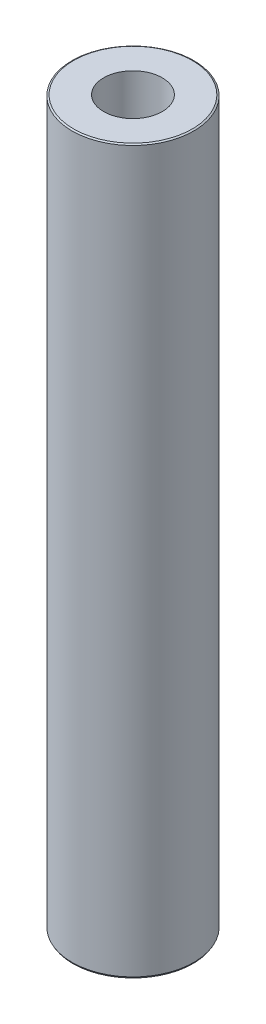
ISO-10303-21;
HEADER;
FILE_DESCRIPTION(('STEP AP214'),'2;1');
FILE_NAME('part.step','',(''),(''),'','','');
FILE_SCHEMA(('AUTOMOTIVE_DESIGN { 1 0 10303 214 1 1 1 1 }'));
ENDSEC;
DATA;
#1=APPLICATION_CONTEXT('core data for automotive mechanical design processes');
#2=APPLICATION_PROTOCOL_DEFINITION('international standard','automotive_design',2000,#1);
#3=PRODUCT_CONTEXT('',#1,'mechanical');
#4=PRODUCT('Part','Part','',(#3));
#5=PRODUCT_RELATED_PRODUCT_CATEGORY('part','',(#4));
#6=PRODUCT_DEFINITION_FORMATION('','',#4);
#7=PRODUCT_DEFINITION_CONTEXT('part definition',#1,'design');
#8=PRODUCT_DEFINITION('design','',#6,#7);
#9=PRODUCT_DEFINITION_SHAPE('','',#8);
#10=(LENGTH_UNIT() NAMED_UNIT(*) SI_UNIT(.MILLI.,.METRE.));
#11=(NAMED_UNIT(*) PLANE_ANGLE_UNIT() SI_UNIT($,.RADIAN.));
#12=(NAMED_UNIT(*) SI_UNIT($,.STERADIAN.) SOLID_ANGLE_UNIT());
#13=UNCERTAINTY_MEASURE_WITH_UNIT(LENGTH_MEASURE(1.E-05),#10,'distance_accuracy_value','');
#14=(GEOMETRIC_REPRESENTATION_CONTEXT(3) GLOBAL_UNCERTAINTY_ASSIGNED_CONTEXT((#13)) GLOBAL_UNIT_ASSIGNED_CONTEXT((#10,
#11,#12)) REPRESENTATION_CONTEXT('',''));
#15=CARTESIAN_POINT('',(0.,0.,0.));
#16=DIRECTION('',(0.,0.,1.));
#17=DIRECTION('',(1.,0.,0.));
#18=AXIS2_PLACEMENT_3D('',#15,#16,#17);
#19=CARTESIAN_POINT('',(0.,237.131826389888,0.));
#20=DIRECTION('',(0.,-1.,0.));
#21=DIRECTION('',(0.,0.,-1.));
#22=AXIS2_PLACEMENT_3D('',#19,#20,#21);
#23=CYLINDRICAL_SURFACE('',#22,20.);
#24=CARTESIAN_POINT('',(0.,236.830824335203,0.));
#25=DIRECTION('',(0.,1.,0.));
#26=DIRECTION('',(0.,0.,1.));
#27=AXIS2_PLACEMENT_3D('',#24,#25,#26);
#28=CIRCLE('',#27,20.);
#29=CARTESIAN_POINT('',(0.,236.830824335203,20.));
#30=VERTEX_POINT('',#29);
#31=EDGE_CURVE('E50',#30,#30,#28,.F.);
#32=ORIENTED_EDGE('',*,*,#31,.T.);
#33=EDGE_LOOP('',(#32));
#34=FACE_BOUND('',#33,.T.);
#35=CARTESIAN_POINT('',(0.,0.521350851897973,0.));
#36=DIRECTION('',(0.,1.,0.));
#37=DIRECTION('',(0.,0.,1.));
#38=AXIS2_PLACEMENT_3D('',#35,#36,#37);
#39=CIRCLE('',#38,20.);
#40=CARTESIAN_POINT('',(0.,0.521350851897973,20.));
#41=VERTEX_POINT('',#40);
#42=EDGE_CURVE('E51',#41,#41,#39,.T.);
#43=ORIENTED_EDGE('',*,*,#42,.T.);
#44=EDGE_LOOP('',(#43));
#45=FACE_BOUND('',#44,.T.);
#46=ADVANCED_FACE('F39',(#34,#45),#23,.T.);
#47=CARTESIAN_POINT('',(0.,237.131826389888,0.));
#48=DIRECTION('',(0.,1.,0.));
#49=DIRECTION('',(0.,0.,1.));
#50=AXIS2_PLACEMENT_3D('',#47,#48,#49);
#51=PLANE('',#50);
#52=CARTESIAN_POINT('',(0.,237.131826389888,0.));
#53=DIRECTION('',(0.,1.,0.));
#54=DIRECTION('',(0.,0.,1.));
#55=AXIS2_PLACEMENT_3D('',#52,#53,#54);
#56=CIRCLE('',#55,19.478649148102);
#57=CARTESIAN_POINT('',(0.,237.131826389888,19.478649148102));
#58=VERTEX_POINT('',#57);
#59=EDGE_CURVE('E54',#58,#58,#56,.T.);
#60=ORIENTED_EDGE('',*,*,#59,.T.);
#61=EDGE_LOOP('',(#60));
#62=FACE_BOUND('',#61,.T.);
#63=CARTESIAN_POINT('',(0.,237.131826389888,0.));
#64=DIRECTION('',(0.,1.,0.));
#65=DIRECTION('',(0.,0.,1.));
#66=AXIS2_PLACEMENT_3D('',#63,#64,#65);
#67=CIRCLE('',#66,9.6206422529165);
#68=CARTESIAN_POINT('',(0.,237.131826389888,9.6206422529165));
#69=VERTEX_POINT('',#68);
#70=EDGE_CURVE('E58',#69,#69,#67,.T.);
#71=ORIENTED_EDGE('',*,*,#70,.F.);
#72=EDGE_LOOP('',(#71));
#73=FACE_BOUND('',#72,.T.);
#74=ADVANCED_FACE('F69',(#62,#73),#51,.T.);
#75=CARTESIAN_POINT('',(0.,0.,0.));
#76=DIRECTION('',(0.,1.,0.));
#77=DIRECTION('',(0.,0.,1.));
#78=AXIS2_PLACEMENT_3D('',#75,#76,#77);
#79=PLANE('',#78);
#80=CARTESIAN_POINT('',(0.,0.,0.));
#81=DIRECTION('',(0.,1.,0.));
#82=DIRECTION('',(0.,0.,1.));
#83=AXIS2_PLACEMENT_3D('',#80,#81,#82);
#84=CIRCLE('',#83,19.6989979453145);
#85=CARTESIAN_POINT('',(0.,0.,19.6989979453145));
#86=VERTEX_POINT('',#85);
#87=EDGE_CURVE('E10',#86,#86,#84,.F.);
#88=ORIENTED_EDGE('',*,*,#87,.T.);
#89=EDGE_LOOP('',(#88));
#90=FACE_BOUND('',#89,.T.);
#91=CARTESIAN_POINT('',(0.,0.,0.));
#92=DIRECTION('',(0.,1.,0.));
#93=DIRECTION('',(0.,0.,1.));
#94=AXIS2_PLACEMENT_3D('',#91,#92,#93);
#95=CIRCLE('',#94,9.6206422529165);
#96=CARTESIAN_POINT('',(0.,0.,9.6206422529165));
#97=VERTEX_POINT('',#96);
#98=EDGE_CURVE('E63',#97,#97,#95,.T.);
#99=ORIENTED_EDGE('',*,*,#98,.T.);
#100=EDGE_LOOP('',(#99));
#101=FACE_BOUND('',#100,.T.);
#102=ADVANCED_FACE('F75',(#90,#101),#79,.F.);
#103=CARTESIAN_POINT('',(0.,237.131826389888,0.));
#104=DIRECTION('',(0.,-1.,0.));
#105=DIRECTION('',(0.,0.,-1.));
#106=AXIS2_PLACEMENT_3D('',#103,#104,#105);
#107=CYLINDRICAL_SURFACE('',#106,9.6206422529165);
#108=ORIENTED_EDGE('',*,*,#70,.T.);
#109=EDGE_LOOP('',(#108));
#110=FACE_BOUND('',#109,.T.);
#111=ORIENTED_EDGE('',*,*,#98,.F.);
#112=EDGE_LOOP('',(#111));
#113=FACE_BOUND('',#112,.T.);
#114=ADVANCED_FACE('F70',(#110,#113),#107,.F.);
#115=CARTESIAN_POINT('',(0.,237.131826389888,0.));
#116=DIRECTION('',(0.,-1.,0.));
#117=DIRECTION('',(0.,0.,-1.));
#118=AXIS2_PLACEMENT_3D('',#115,#116,#117);
#119=CONICAL_SURFACE('',#118,19.478649148102,1.04719755119658);
#120=ORIENTED_EDGE('',*,*,#31,.F.);
#121=EDGE_LOOP('',(#120));
#122=FACE_BOUND('',#121,.T.);
#123=ORIENTED_EDGE('',*,*,#59,.F.);
#124=EDGE_LOOP('',(#123));
#125=FACE_BOUND('',#124,.T.);
#126=ADVANCED_FACE('F81',(#122,#125),#119,.T.);
#127=CARTESIAN_POINT('',(0.,0.521350851897973,0.));
#128=DIRECTION('',(0.,1.,0.));
#129=DIRECTION('',(0.,0.,1.));
#130=AXIS2_PLACEMENT_3D('',#127,#128,#129);
#131=CONICAL_SURFACE('',#130,20.,0.523598775598304);
#132=ORIENTED_EDGE('',*,*,#87,.F.);
#133=EDGE_LOOP('',(#132));
#134=FACE_BOUND('',#133,.T.);
#135=ORIENTED_EDGE('',*,*,#42,.F.);
#136=EDGE_LOOP('',(#135));
#137=FACE_BOUND('',#136,.T.);
#138=ADVANCED_FACE('F45',(#134,#137),#131,.T.);
#139=CLOSED_SHELL('',(#46,#74,#102,#114,#126,#138));
#140=MANIFOLD_SOLID_BREP('B2',#139);
#141=ADVANCED_BREP_SHAPE_REPRESENTATION('',(#18,#140),#14);
#142=SHAPE_DEFINITION_REPRESENTATION(#9,#141);
ENDSEC;
END-ISO-10303-21;
